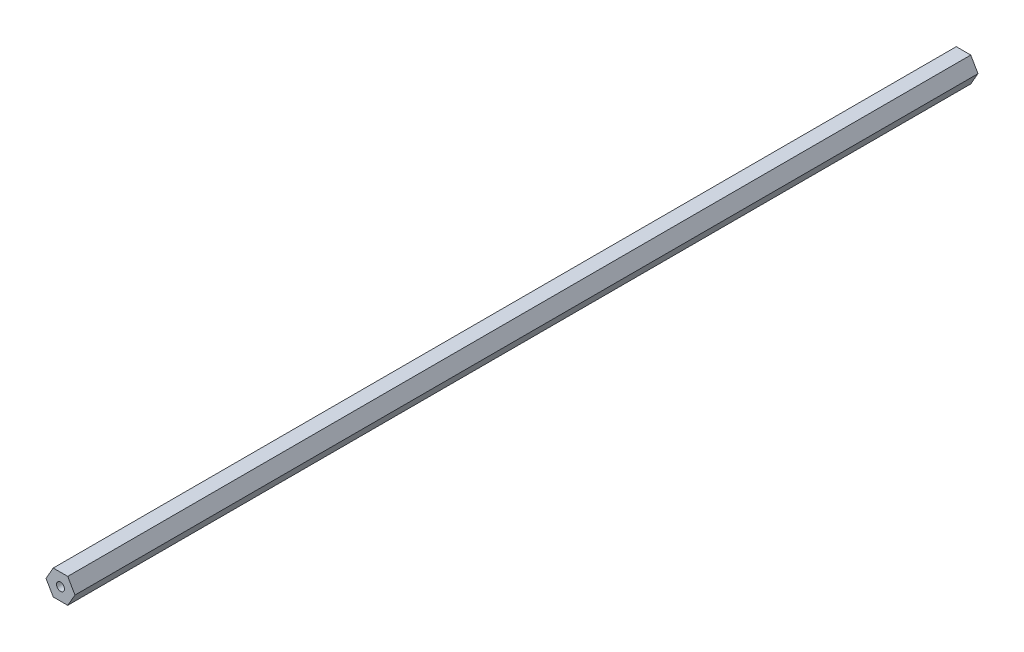
ISO-10303-21;
HEADER;
FILE_DESCRIPTION(('STEP AP214'),'2;1');
FILE_NAME('part.step','',(''),(''),'','','');
FILE_SCHEMA(('AUTOMOTIVE_DESIGN { 1 0 10303 214 1 1 1 1 }'));
ENDSEC;
DATA;
#1=APPLICATION_CONTEXT('core data for automotive mechanical design processes');
#2=APPLICATION_PROTOCOL_DEFINITION('international standard','automotive_design',2000,#1);
#3=PRODUCT_CONTEXT('',#1,'mechanical');
#4=PRODUCT('Part','Part','',(#3));
#5=PRODUCT_RELATED_PRODUCT_CATEGORY('part','',(#4));
#6=PRODUCT_DEFINITION_FORMATION('','',#4);
#7=PRODUCT_DEFINITION_CONTEXT('part definition',#1,'design');
#8=PRODUCT_DEFINITION('design','',#6,#7);
#9=PRODUCT_DEFINITION_SHAPE('','',#8);
#10=(LENGTH_UNIT() NAMED_UNIT(*) SI_UNIT(.MILLI.,.METRE.));
#11=(NAMED_UNIT(*) PLANE_ANGLE_UNIT() SI_UNIT($,.RADIAN.));
#12=(NAMED_UNIT(*) SI_UNIT($,.STERADIAN.) SOLID_ANGLE_UNIT());
#13=UNCERTAINTY_MEASURE_WITH_UNIT(LENGTH_MEASURE(1.E-05),#10,'distance_accuracy_value','');
#14=(GEOMETRIC_REPRESENTATION_CONTEXT(3) GLOBAL_UNCERTAINTY_ASSIGNED_CONTEXT((#13)) GLOBAL_UNIT_ASSIGNED_CONTEXT((#10,
#11,#12)) REPRESENTATION_CONTEXT('',''));
#15=CARTESIAN_POINT('',(0.,0.,0.));
#16=DIRECTION('',(0.,0.,1.));
#17=DIRECTION('',(1.,0.,0.));
#18=AXIS2_PLACEMENT_3D('',#15,#16,#17);
#19=CARTESIAN_POINT('',(0.,0.,0.));
#20=DIRECTION('',(0.,0.,1.));
#21=DIRECTION('',(1.,0.,0.));
#22=AXIS2_PLACEMENT_3D('',#19,#20,#21);
#23=PLANE('',#22);
#24=CARTESIAN_POINT('',(0.,0.,0.));
#25=DIRECTION('',(0.,0.,-1.));
#26=DIRECTION('',(-1.,0.,0.));
#27=AXIS2_PLACEMENT_3D('',#24,#25,#26);
#28=CIRCLE('',#27,2.0193);
#29=CARTESIAN_POINT('',(2.0193,0.,0.));
#30=VERTEX_POINT('',#29);
#31=EDGE_CURVE('E138',#30,#30,#28,.T.);
#32=ORIENTED_EDGE('',*,*,#31,.F.);
#33=EDGE_LOOP('',(#32));
#34=FACE_BOUND('',#33,.T.);
#35=DIRECTION('',(-0.5,-0.866025403784438,0.));
#36=VECTOR('',#35,1.);
#37=CARTESIAN_POINT('',(-3.66617420935411,6.35,0.));
#38=LINE('',#37,#36);
#39=CARTESIAN_POINT('',(-3.66617420935411,6.35,0.));
#40=VERTEX_POINT('',#39);
#41=CARTESIAN_POINT('',(-7.33234841870825,0.,0.));
#42=VERTEX_POINT('',#41);
#43=EDGE_CURVE('E25',#40,#42,#38,.T.);
#44=ORIENTED_EDGE('',*,*,#43,.F.);
#45=DIRECTION('',(-1.,0.,0.));
#46=VECTOR('',#45,1.);
#47=CARTESIAN_POINT('',(3.66617420935411,6.35,0.));
#48=LINE('',#47,#46);
#49=CARTESIAN_POINT('',(3.66617420935411,6.35,0.));
#50=VERTEX_POINT('',#49);
#51=EDGE_CURVE('E141',#50,#40,#48,.T.);
#52=ORIENTED_EDGE('',*,*,#51,.F.);
#53=DIRECTION('',(-0.5,0.866025403784439,0.));
#54=VECTOR('',#53,1.);
#55=CARTESIAN_POINT('',(7.33234841870825,0.,0.));
#56=LINE('',#55,#54);
#57=CARTESIAN_POINT('',(7.33234841870825,0.,0.));
#58=VERTEX_POINT('',#57);
#59=EDGE_CURVE('E150',#58,#50,#56,.T.);
#60=ORIENTED_EDGE('',*,*,#59,.F.);
#61=DIRECTION('',(0.5,0.866025403784438,0.));
#62=VECTOR('',#61,1.);
#63=CARTESIAN_POINT('',(3.66617420935411,-6.35,0.));
#64=LINE('',#63,#62);
#65=CARTESIAN_POINT('',(3.66617420935411,-6.35,0.));
#66=VERTEX_POINT('',#65);
#67=EDGE_CURVE('E113',#66,#58,#64,.T.);
#68=ORIENTED_EDGE('',*,*,#67,.F.);
#69=DIRECTION('',(1.,0.,0.));
#70=VECTOR('',#69,1.);
#71=CARTESIAN_POINT('',(-3.66617420935414,-6.35,0.));
#72=LINE('',#71,#70);
#73=CARTESIAN_POINT('',(-3.66617420935414,-6.35,0.));
#74=VERTEX_POINT('',#73);
#75=EDGE_CURVE('E106',#74,#66,#72,.T.);
#76=ORIENTED_EDGE('',*,*,#75,.F.);
#77=DIRECTION('',(0.5,-0.866025403784439,0.));
#78=VECTOR('',#77,1.);
#79=CARTESIAN_POINT('',(-7.33234841870825,0.,0.));
#80=LINE('',#79,#78);
#81=EDGE_CURVE('E91',#42,#74,#80,.T.);
#82=ORIENTED_EDGE('',*,*,#81,.F.);
#83=EDGE_LOOP('',(#44,#52,#60,#68,#76,#82));
#84=FACE_BOUND('',#83,.T.);
#85=ADVANCED_FACE('F17',(#34,#84),#23,.F.);
#86=CARTESIAN_POINT('',(0.,0.,457.2));
#87=DIRECTION('',(0.,0.,1.));
#88=DIRECTION('',(1.,0.,0.));
#89=AXIS2_PLACEMENT_3D('',#86,#87,#88);
#90=PLANE('',#89);
#91=CARTESIAN_POINT('',(0.,0.,457.2));
#92=DIRECTION('',(0.,0.,-1.));
#93=DIRECTION('',(-1.,0.,0.));
#94=AXIS2_PLACEMENT_3D('',#91,#92,#93);
#95=CIRCLE('',#94,2.0193);
#96=CARTESIAN_POINT('',(2.0193,0.,457.2));
#97=VERTEX_POINT('',#96);
#98=EDGE_CURVE('E135',#97,#97,#95,.T.);
#99=ORIENTED_EDGE('',*,*,#98,.T.);
#100=EDGE_LOOP('',(#99));
#101=FACE_BOUND('',#100,.T.);
#102=DIRECTION('',(-0.5,-0.866025403784438,0.));
#103=VECTOR('',#102,1.);
#104=CARTESIAN_POINT('',(-3.66617420935411,6.35,457.2));
#105=LINE('',#104,#103);
#106=CARTESIAN_POINT('',(-3.66617420935411,6.35,457.2));
#107=VERTEX_POINT('',#106);
#108=CARTESIAN_POINT('',(-7.33234841870825,0.,457.2));
#109=VERTEX_POINT('',#108);
#110=EDGE_CURVE('E11',#107,#109,#105,.T.);
#111=ORIENTED_EDGE('',*,*,#110,.T.);
#112=DIRECTION('',(0.5,-0.866025403784439,0.));
#113=VECTOR('',#112,1.);
#114=CARTESIAN_POINT('',(-7.33234841870825,0.,457.2));
#115=LINE('',#114,#113);
#116=CARTESIAN_POINT('',(-3.66617420935414,-6.35,457.2));
#117=VERTEX_POINT('',#116);
#118=EDGE_CURVE('E101',#109,#117,#115,.T.);
#119=ORIENTED_EDGE('',*,*,#118,.T.);
#120=DIRECTION('',(1.,0.,0.));
#121=VECTOR('',#120,1.);
#122=CARTESIAN_POINT('',(-3.66617420935414,-6.35,457.2));
#123=LINE('',#122,#121);
#124=CARTESIAN_POINT('',(3.66617420935411,-6.35,457.2));
#125=VERTEX_POINT('',#124);
#126=EDGE_CURVE('E108',#117,#125,#123,.T.);
#127=ORIENTED_EDGE('',*,*,#126,.T.);
#128=DIRECTION('',(0.5,0.866025403784438,0.));
#129=VECTOR('',#128,1.);
#130=CARTESIAN_POINT('',(3.66617420935411,-6.35,457.2));
#131=LINE('',#130,#129);
#132=CARTESIAN_POINT('',(7.33234841870825,0.,457.2));
#133=VERTEX_POINT('',#132);
#134=EDGE_CURVE('E121',#125,#133,#131,.T.);
#135=ORIENTED_EDGE('',*,*,#134,.T.);
#136=DIRECTION('',(-0.5,0.866025403784439,0.));
#137=VECTOR('',#136,1.);
#138=CARTESIAN_POINT('',(7.33234841870825,0.,457.2));
#139=LINE('',#138,#137);
#140=CARTESIAN_POINT('',(3.66617420935411,6.35,457.2));
#141=VERTEX_POINT('',#140);
#142=EDGE_CURVE('E153',#133,#141,#139,.T.);
#143=ORIENTED_EDGE('',*,*,#142,.T.);
#144=DIRECTION('',(-1.,0.,0.));
#145=VECTOR('',#144,1.);
#146=CARTESIAN_POINT('',(3.66617420935411,6.35,457.2));
#147=LINE('',#146,#145);
#148=EDGE_CURVE('E158',#141,#107,#147,.T.);
#149=ORIENTED_EDGE('',*,*,#148,.T.);
#150=EDGE_LOOP('',(#111,#119,#127,#135,#143,#149));
#151=FACE_BOUND('',#150,.T.);
#152=ADVANCED_FACE('F171',(#101,#151),#90,.T.);
#153=CARTESIAN_POINT('',(-3.66617420935411,6.35,0.));
#154=DIRECTION('',(-0.866025403784439,0.5,0.));
#155=DIRECTION('',(0.,0.,1.));
#156=AXIS2_PLACEMENT_3D('',#153,#154,#155);
#157=PLANE('',#156);
#158=ORIENTED_EDGE('',*,*,#43,.T.);
#159=DIRECTION('',(0.,0.,1.));
#160=VECTOR('',#159,1.);
#161=CARTESIAN_POINT('',(-7.33234841870825,0.,0.));
#162=LINE('',#161,#160);
#163=EDGE_CURVE('E97',#42,#109,#162,.T.);
#164=ORIENTED_EDGE('',*,*,#163,.T.);
#165=ORIENTED_EDGE('',*,*,#110,.F.);
#166=DIRECTION('',(0.,0.,1.));
#167=VECTOR('',#166,1.);
#168=CARTESIAN_POINT('',(-3.66617420935411,6.35,0.));
#169=LINE('',#168,#167);
#170=EDGE_CURVE('E146',#40,#107,#169,.T.);
#171=ORIENTED_EDGE('',*,*,#170,.F.);
#172=EDGE_LOOP('',(#158,#164,#165,#171));
#173=FACE_BOUND('',#172,.T.);
#174=ADVANCED_FACE('F183',(#173),#157,.T.);
#175=CARTESIAN_POINT('',(-7.33234841870825,0.,0.));
#176=DIRECTION('',(-0.866025403784439,-0.5,0.));
#177=DIRECTION('',(-0.5,0.866025403784439,0.));
#178=AXIS2_PLACEMENT_3D('',#175,#176,#177);
#179=PLANE('',#178);
#180=ORIENTED_EDGE('',*,*,#81,.T.);
#181=DIRECTION('',(0.,0.,1.));
#182=VECTOR('',#181,1.);
#183=CARTESIAN_POINT('',(-3.66617420935414,-6.35,0.));
#184=LINE('',#183,#182);
#185=EDGE_CURVE('E95',#74,#117,#184,.T.);
#186=ORIENTED_EDGE('',*,*,#185,.T.);
#187=ORIENTED_EDGE('',*,*,#118,.F.);
#188=ORIENTED_EDGE('',*,*,#163,.F.);
#189=EDGE_LOOP('',(#180,#186,#187,#188));
#190=FACE_BOUND('',#189,.T.);
#191=ADVANCED_FACE('F93',(#190),#179,.T.);
#192=CARTESIAN_POINT('',(-3.66617420935414,-6.35,0.));
#193=DIRECTION('',(0.,-1.,0.));
#194=DIRECTION('',(-1.,0.,0.));
#195=AXIS2_PLACEMENT_3D('',#192,#193,#194);
#196=PLANE('',#195);
#197=ORIENTED_EDGE('',*,*,#75,.T.);
#198=DIRECTION('',(0.,0.,1.));
#199=VECTOR('',#198,1.);
#200=CARTESIAN_POINT('',(3.66617420935411,-6.35,0.));
#201=LINE('',#200,#199);
#202=EDGE_CURVE('E115',#66,#125,#201,.T.);
#203=ORIENTED_EDGE('',*,*,#202,.T.);
#204=ORIENTED_EDGE('',*,*,#126,.F.);
#205=ORIENTED_EDGE('',*,*,#185,.F.);
#206=EDGE_LOOP('',(#197,#203,#204,#205));
#207=FACE_BOUND('',#206,.T.);
#208=ADVANCED_FACE('F104',(#207),#196,.T.);
#209=CARTESIAN_POINT('',(3.66617420935411,-6.35,0.));
#210=DIRECTION('',(0.866025403784439,-0.5,0.));
#211=DIRECTION('',(0.,0.,-1.));
#212=AXIS2_PLACEMENT_3D('',#209,#210,#211);
#213=PLANE('',#212);
#214=ORIENTED_EDGE('',*,*,#67,.T.);
#215=DIRECTION('',(0.,0.,1.));
#216=VECTOR('',#215,1.);
#217=CARTESIAN_POINT('',(7.33234841870825,0.,0.));
#218=LINE('',#217,#216);
#219=EDGE_CURVE('E149',#58,#133,#218,.T.);
#220=ORIENTED_EDGE('',*,*,#219,.T.);
#221=ORIENTED_EDGE('',*,*,#134,.F.);
#222=ORIENTED_EDGE('',*,*,#202,.F.);
#223=EDGE_LOOP('',(#214,#220,#221,#222));
#224=FACE_BOUND('',#223,.T.);
#225=ADVANCED_FACE('F175',(#224),#213,.T.);
#226=CARTESIAN_POINT('',(7.33234841870825,0.,0.));
#227=DIRECTION('',(0.866025403784439,0.5,0.));
#228=DIRECTION('',(0.,0.,-1.));
#229=AXIS2_PLACEMENT_3D('',#226,#227,#228);
#230=PLANE('',#229);
#231=ORIENTED_EDGE('',*,*,#59,.T.);
#232=DIRECTION('',(0.,0.,1.));
#233=VECTOR('',#232,1.);
#234=CARTESIAN_POINT('',(3.66617420935411,6.35,0.));
#235=LINE('',#234,#233);
#236=EDGE_CURVE('E154',#50,#141,#235,.T.);
#237=ORIENTED_EDGE('',*,*,#236,.T.);
#238=ORIENTED_EDGE('',*,*,#142,.F.);
#239=ORIENTED_EDGE('',*,*,#219,.F.);
#240=EDGE_LOOP('',(#231,#237,#238,#239));
#241=FACE_BOUND('',#240,.T.);
#242=ADVANCED_FACE('F177',(#241),#230,.T.);
#243=CARTESIAN_POINT('',(3.66617420935411,6.35,0.));
#244=DIRECTION('',(0.,1.,0.));
#245=DIRECTION('',(1.,0.,0.));
#246=AXIS2_PLACEMENT_3D('',#243,#244,#245);
#247=PLANE('',#246);
#248=ORIENTED_EDGE('',*,*,#51,.T.);
#249=ORIENTED_EDGE('',*,*,#170,.T.);
#250=ORIENTED_EDGE('',*,*,#148,.F.);
#251=ORIENTED_EDGE('',*,*,#236,.F.);
#252=EDGE_LOOP('',(#248,#249,#250,#251));
#253=FACE_BOUND('',#252,.T.);
#254=ADVANCED_FACE('F182',(#253),#247,.T.);
#255=CARTESIAN_POINT('',(0.,0.,0.));
#256=DIRECTION('',(0.,0.,1.));
#257=DIRECTION('',(-1.,0.,0.));
#258=AXIS2_PLACEMENT_3D('',#255,#256,#257);
#259=CYLINDRICAL_SURFACE('',#258,2.0193);
#260=ORIENTED_EDGE('',*,*,#98,.F.);
#261=DIRECTION('',(0.,0.,-1.));
#262=VECTOR('',#261,1.);
#263=CARTESIAN_POINT('',(2.0193,0.,0.));
#264=LINE('',#263,#262);
#265=EDGE_CURVE('E136',#97,#30,#264,.T.);
#266=ORIENTED_EDGE('',*,*,#265,.T.);
#267=ORIENTED_EDGE('',*,*,#31,.T.);
#268=ORIENTED_EDGE('',*,*,#265,.F.);
#269=EDGE_LOOP('',(#260,#266,#267,#268));
#270=FACE_BOUND('',#269,.T.);
#271=ADVANCED_FACE('F204',(#270),#259,.F.);
#272=CLOSED_SHELL('',(#85,#152,#174,#191,#208,#225,#242,#254,#271));
#273=MANIFOLD_SOLID_BREP('B1',#272);
#274=ADVANCED_BREP_SHAPE_REPRESENTATION('',(#18,#273),#14);
#275=SHAPE_DEFINITION_REPRESENTATION(#9,#274);
ENDSEC;
END-ISO-10303-21;
